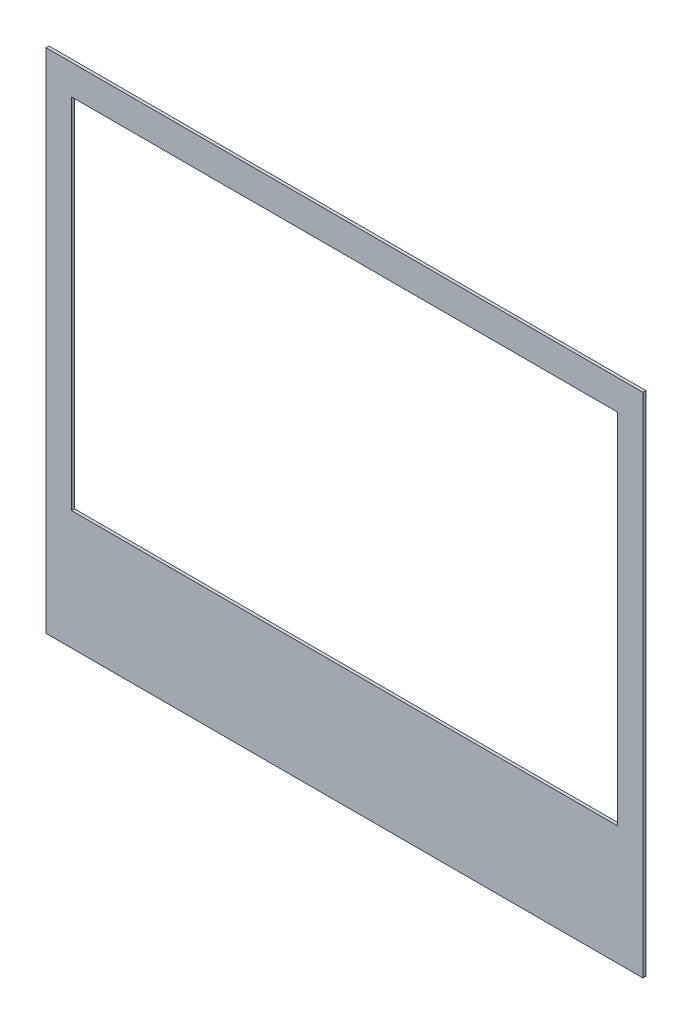
ISO-10303-21;
HEADER;
FILE_DESCRIPTION(('STEP AP214'),'2;1');
FILE_NAME('part.step','',(''),(''),'','','');
FILE_SCHEMA(('AUTOMOTIVE_DESIGN { 1 0 10303 214 1 1 1 1 }'));
ENDSEC;
DATA;
#1=APPLICATION_CONTEXT('core data for automotive mechanical design processes');
#2=APPLICATION_PROTOCOL_DEFINITION('international standard','automotive_design',2000,#1);
#3=PRODUCT_CONTEXT('',#1,'mechanical');
#4=PRODUCT('Part','Part','',(#3));
#5=PRODUCT_RELATED_PRODUCT_CATEGORY('part','',(#4));
#6=PRODUCT_DEFINITION_FORMATION('','',#4);
#7=PRODUCT_DEFINITION_CONTEXT('part definition',#1,'design');
#8=PRODUCT_DEFINITION('design','',#6,#7);
#9=PRODUCT_DEFINITION_SHAPE('','',#8);
#10=(LENGTH_UNIT() NAMED_UNIT(*) SI_UNIT(.MILLI.,.METRE.));
#11=(NAMED_UNIT(*) PLANE_ANGLE_UNIT() SI_UNIT($,.RADIAN.));
#12=(NAMED_UNIT(*) SI_UNIT($,.STERADIAN.) SOLID_ANGLE_UNIT());
#13=UNCERTAINTY_MEASURE_WITH_UNIT(LENGTH_MEASURE(1.E-05),#10,'distance_accuracy_value','');
#14=(GEOMETRIC_REPRESENTATION_CONTEXT(3) GLOBAL_UNCERTAINTY_ASSIGNED_CONTEXT((#13)) GLOBAL_UNIT_ASSIGNED_CONTEXT((#10,
#11,#12)) REPRESENTATION_CONTEXT('',''));
#15=CARTESIAN_POINT('',(0.,0.,0.));
#16=DIRECTION('',(0.,0.,1.));
#17=DIRECTION('',(1.,0.,0.));
#18=AXIS2_PLACEMENT_3D('',#15,#16,#17);
#19=CARTESIAN_POINT('',(0.,0.,0.2));
#20=DIRECTION('',(0.,0.,-1.));
#21=DIRECTION('',(-1.,0.,0.));
#22=AXIS2_PLACEMENT_3D('',#19,#20,#21);
#23=PLANE('',#22);
#24=DIRECTION('',(0.,-1.,0.));
#25=VECTOR('',#24,1.);
#26=CARTESIAN_POINT('',(0.,0.,0.2));
#27=LINE('',#26,#25);
#28=CARTESIAN_POINT('',(0.,33.98,0.2));
#29=VERTEX_POINT('',#28);
#30=CARTESIAN_POINT('',(0.,0.,0.2));
#31=VERTEX_POINT('',#30);
#32=EDGE_CURVE('E136',#29,#31,#27,.T.);
#33=ORIENTED_EDGE('',*,*,#32,.T.);
#34=DIRECTION('',(1.,0.,0.));
#35=VECTOR('',#34,1.);
#36=CARTESIAN_POINT('',(0.,0.,0.2));
#37=LINE('',#36,#35);
#38=CARTESIAN_POINT('',(39.98,0.,0.2));
#39=VERTEX_POINT('',#38);
#40=EDGE_CURVE('E139',#31,#39,#37,.T.);
#41=ORIENTED_EDGE('',*,*,#40,.T.);
#42=DIRECTION('',(0.,1.,0.));
#43=VECTOR('',#42,1.);
#44=CARTESIAN_POINT('',(39.98,0.,0.2));
#45=LINE('',#44,#43);
#46=CARTESIAN_POINT('',(39.98,33.98,0.2));
#47=VERTEX_POINT('',#46);
#48=EDGE_CURVE('E142',#39,#47,#45,.T.);
#49=ORIENTED_EDGE('',*,*,#48,.T.);
#50=DIRECTION('',(-1.,0.,0.));
#51=VECTOR('',#50,1.);
#52=CARTESIAN_POINT('',(0.,33.98,0.2));
#53=LINE('',#52,#51);
#54=EDGE_CURVE('E144',#47,#29,#53,.T.);
#55=ORIENTED_EDGE('',*,*,#54,.T.);
#56=EDGE_LOOP('',(#33,#41,#49,#55));
#57=FACE_BOUND('',#56,.T.);
#58=DIRECTION('',(0.,-1.,0.));
#59=VECTOR('',#58,1.);
#60=CARTESIAN_POINT('',(1.7,31.98,0.2));
#61=LINE('',#60,#59);
#62=CARTESIAN_POINT('',(1.7,31.98,0.2));
#63=VERTEX_POINT('',#62);
#64=CARTESIAN_POINT('',(1.7,7.97999999999999,0.2));
#65=VERTEX_POINT('',#64);
#66=EDGE_CURVE('E100',#63,#65,#61,.T.);
#67=ORIENTED_EDGE('',*,*,#66,.F.);
#68=DIRECTION('',(-1.,0.,0.));
#69=VECTOR('',#68,1.);
#70=CARTESIAN_POINT('',(1.7,31.98,0.2));
#71=LINE('',#70,#69);
#72=CARTESIAN_POINT('',(38.28,31.98,0.2));
#73=VERTEX_POINT('',#72);
#74=EDGE_CURVE('E122',#73,#63,#71,.T.);
#75=ORIENTED_EDGE('',*,*,#74,.F.);
#76=DIRECTION('',(0.,1.,0.));
#77=VECTOR('',#76,1.);
#78=CARTESIAN_POINT('',(38.28,31.98,0.2));
#79=LINE('',#78,#77);
#80=CARTESIAN_POINT('',(38.28,7.97999999999999,0.2));
#81=VERTEX_POINT('',#80);
#82=EDGE_CURVE('E120',#81,#73,#79,.T.);
#83=ORIENTED_EDGE('',*,*,#82,.F.);
#84=DIRECTION('',(1.,0.,0.));
#85=VECTOR('',#84,1.);
#86=CARTESIAN_POINT('',(1.7,7.97999999999999,0.2));
#87=LINE('',#86,#85);
#88=EDGE_CURVE('E108',#65,#81,#87,.T.);
#89=ORIENTED_EDGE('',*,*,#88,.F.);
#90=EDGE_LOOP('',(#67,#75,#83,#89));
#91=FACE_BOUND('',#90,.T.);
#92=ADVANCED_FACE('F35',(#57,#91),#23,.F.);
#93=CARTESIAN_POINT('',(0.,0.,0.));
#94=DIRECTION('',(0.,0.,-1.));
#95=DIRECTION('',(-1.,0.,0.));
#96=AXIS2_PLACEMENT_3D('',#93,#94,#95);
#97=PLANE('',#96);
#98=DIRECTION('',(0.,-1.,0.));
#99=VECTOR('',#98,1.);
#100=CARTESIAN_POINT('',(0.,0.,0.));
#101=LINE('',#100,#99);
#102=CARTESIAN_POINT('',(0.,33.98,0.));
#103=VERTEX_POINT('',#102);
#104=CARTESIAN_POINT('',(0.,0.,0.));
#105=VERTEX_POINT('',#104);
#106=EDGE_CURVE('E116',#103,#105,#101,.T.);
#107=ORIENTED_EDGE('',*,*,#106,.F.);
#108=DIRECTION('',(-1.,0.,0.));
#109=VECTOR('',#108,1.);
#110=CARTESIAN_POINT('',(0.,33.98,0.));
#111=LINE('',#110,#109);
#112=CARTESIAN_POINT('',(39.98,33.98,0.));
#113=VERTEX_POINT('',#112);
#114=EDGE_CURVE('E140',#113,#103,#111,.T.);
#115=ORIENTED_EDGE('',*,*,#114,.F.);
#116=DIRECTION('',(0.,1.,0.));
#117=VECTOR('',#116,1.);
#118=CARTESIAN_POINT('',(39.98,0.,0.));
#119=LINE('',#118,#117);
#120=CARTESIAN_POINT('',(39.98,0.,0.));
#121=VERTEX_POINT('',#120);
#122=EDGE_CURVE('E151',#121,#113,#119,.T.);
#123=ORIENTED_EDGE('',*,*,#122,.F.);
#124=DIRECTION('',(1.,0.,0.));
#125=VECTOR('',#124,1.);
#126=CARTESIAN_POINT('',(0.,0.,0.));
#127=LINE('',#126,#125);
#128=EDGE_CURVE('E149',#105,#121,#127,.T.);
#129=ORIENTED_EDGE('',*,*,#128,.F.);
#130=EDGE_LOOP('',(#107,#115,#123,#129));
#131=FACE_BOUND('',#130,.T.);
#132=DIRECTION('',(-1.,0.,0.));
#133=VECTOR('',#132,1.);
#134=CARTESIAN_POINT('',(1.7,31.98,0.));
#135=LINE('',#134,#133);
#136=CARTESIAN_POINT('',(38.28,31.98,0.));
#137=VERTEX_POINT('',#136);
#138=CARTESIAN_POINT('',(1.7,31.98,0.));
#139=VERTEX_POINT('',#138);
#140=EDGE_CURVE('E109',#137,#139,#135,.T.);
#141=ORIENTED_EDGE('',*,*,#140,.T.);
#142=DIRECTION('',(0.,-1.,0.));
#143=VECTOR('',#142,1.);
#144=CARTESIAN_POINT('',(1.7,31.98,0.));
#145=LINE('',#144,#143);
#146=CARTESIAN_POINT('',(1.7,7.97999999999999,0.));
#147=VERTEX_POINT('',#146);
#148=EDGE_CURVE('E58',#139,#147,#145,.T.);
#149=ORIENTED_EDGE('',*,*,#148,.T.);
#150=DIRECTION('',(1.,0.,0.));
#151=VECTOR('',#150,1.);
#152=CARTESIAN_POINT('',(1.7,7.97999999999999,0.));
#153=LINE('',#152,#151);
#154=CARTESIAN_POINT('',(38.28,7.97999999999999,0.));
#155=VERTEX_POINT('',#154);
#156=EDGE_CURVE('E115',#147,#155,#153,.T.);
#157=ORIENTED_EDGE('',*,*,#156,.T.);
#158=DIRECTION('',(0.,1.,0.));
#159=VECTOR('',#158,1.);
#160=CARTESIAN_POINT('',(38.28,31.98,0.));
#161=LINE('',#160,#159);
#162=EDGE_CURVE('E128',#155,#137,#161,.T.);
#163=ORIENTED_EDGE('',*,*,#162,.T.);
#164=EDGE_LOOP('',(#141,#149,#157,#163));
#165=FACE_BOUND('',#164,.T.);
#166=ADVANCED_FACE('F169',(#131,#165),#97,.T.);
#167=CARTESIAN_POINT('',(0.,0.,0.2));
#168=DIRECTION('',(1.,0.,0.));
#169=DIRECTION('',(0.,0.,-1.));
#170=AXIS2_PLACEMENT_3D('',#167,#168,#169);
#171=PLANE('',#170);
#172=ORIENTED_EDGE('',*,*,#106,.T.);
#173=DIRECTION('',(0.,0.,-1.));
#174=VECTOR('',#173,1.);
#175=CARTESIAN_POINT('',(0.,0.,0.2));
#176=LINE('',#175,#174);
#177=EDGE_CURVE('E11',#31,#105,#176,.T.);
#178=ORIENTED_EDGE('',*,*,#177,.F.);
#179=ORIENTED_EDGE('',*,*,#32,.F.);
#180=DIRECTION('',(0.,0.,-1.));
#181=VECTOR('',#180,1.);
#182=CARTESIAN_POINT('',(0.,33.98,0.2));
#183=LINE('',#182,#181);
#184=EDGE_CURVE('E146',#29,#103,#183,.T.);
#185=ORIENTED_EDGE('',*,*,#184,.T.);
#186=EDGE_LOOP('',(#172,#178,#179,#185));
#187=FACE_BOUND('',#186,.T.);
#188=ADVANCED_FACE('F37',(#187),#171,.F.);
#189=CARTESIAN_POINT('',(0.,0.,0.2));
#190=DIRECTION('',(0.,1.,0.));
#191=DIRECTION('',(0.,0.,1.));
#192=AXIS2_PLACEMENT_3D('',#189,#190,#191);
#193=PLANE('',#192);
#194=ORIENTED_EDGE('',*,*,#128,.T.);
#195=DIRECTION('',(0.,0.,-1.));
#196=VECTOR('',#195,1.);
#197=CARTESIAN_POINT('',(39.98,0.,0.2));
#198=LINE('',#197,#196);
#199=EDGE_CURVE('E43',#39,#121,#198,.T.);
#200=ORIENTED_EDGE('',*,*,#199,.F.);
#201=ORIENTED_EDGE('',*,*,#40,.F.);
#202=ORIENTED_EDGE('',*,*,#177,.T.);
#203=EDGE_LOOP('',(#194,#200,#201,#202));
#204=FACE_BOUND('',#203,.T.);
#205=ADVANCED_FACE('F179',(#204),#193,.F.);
#206=CARTESIAN_POINT('',(39.98,0.,0.2));
#207=DIRECTION('',(-1.,0.,0.));
#208=DIRECTION('',(0.,0.,1.));
#209=AXIS2_PLACEMENT_3D('',#206,#207,#208);
#210=PLANE('',#209);
#211=ORIENTED_EDGE('',*,*,#122,.T.);
#212=DIRECTION('',(0.,0.,-1.));
#213=VECTOR('',#212,1.);
#214=CARTESIAN_POINT('',(39.98,33.98,0.2));
#215=LINE('',#214,#213);
#216=EDGE_CURVE('E156',#47,#113,#215,.T.);
#217=ORIENTED_EDGE('',*,*,#216,.F.);
#218=ORIENTED_EDGE('',*,*,#48,.F.);
#219=ORIENTED_EDGE('',*,*,#199,.T.);
#220=EDGE_LOOP('',(#211,#217,#218,#219));
#221=FACE_BOUND('',#220,.T.);
#222=ADVANCED_FACE('F163',(#221),#210,.F.);
#223=CARTESIAN_POINT('',(0.,33.98,0.2));
#224=DIRECTION('',(0.,-1.,0.));
#225=DIRECTION('',(0.,0.,-1.));
#226=AXIS2_PLACEMENT_3D('',#223,#224,#225);
#227=PLANE('',#226);
#228=ORIENTED_EDGE('',*,*,#114,.T.);
#229=ORIENTED_EDGE('',*,*,#184,.F.);
#230=ORIENTED_EDGE('',*,*,#54,.F.);
#231=ORIENTED_EDGE('',*,*,#216,.T.);
#232=EDGE_LOOP('',(#228,#229,#230,#231));
#233=FACE_BOUND('',#232,.T.);
#234=ADVANCED_FACE('F173',(#233),#227,.F.);
#235=CARTESIAN_POINT('',(1.7,31.98,0.2));
#236=DIRECTION('',(1.,0.,0.));
#237=DIRECTION('',(0.,1.,0.));
#238=AXIS2_PLACEMENT_3D('',#235,#236,#237);
#239=PLANE('',#238);
#240=ORIENTED_EDGE('',*,*,#148,.F.);
#241=DIRECTION('',(0.,0.,-1.));
#242=VECTOR('',#241,1.);
#243=CARTESIAN_POINT('',(1.7,31.98,0.2));
#244=LINE('',#243,#242);
#245=EDGE_CURVE('E104',#63,#139,#244,.T.);
#246=ORIENTED_EDGE('',*,*,#245,.F.);
#247=ORIENTED_EDGE('',*,*,#66,.T.);
#248=DIRECTION('',(0.,0.,-1.));
#249=VECTOR('',#248,1.);
#250=CARTESIAN_POINT('',(1.7,7.97999999999999,0.2));
#251=LINE('',#250,#249);
#252=EDGE_CURVE('E103',#65,#147,#251,.T.);
#253=ORIENTED_EDGE('',*,*,#252,.T.);
#254=EDGE_LOOP('',(#240,#246,#247,#253));
#255=FACE_BOUND('',#254,.T.);
#256=ADVANCED_FACE('F102',(#255),#239,.T.);
#257=CARTESIAN_POINT('',(1.7,7.97999999999999,0.2));
#258=DIRECTION('',(0.,1.,0.));
#259=DIRECTION('',(0.,0.,1.));
#260=AXIS2_PLACEMENT_3D('',#257,#258,#259);
#261=PLANE('',#260);
#262=ORIENTED_EDGE('',*,*,#156,.F.);
#263=ORIENTED_EDGE('',*,*,#252,.F.);
#264=ORIENTED_EDGE('',*,*,#88,.T.);
#265=DIRECTION('',(0.,0.,-1.));
#266=VECTOR('',#265,1.);
#267=CARTESIAN_POINT('',(38.28,7.97999999999999,0.2));
#268=LINE('',#267,#266);
#269=EDGE_CURVE('E117',#81,#155,#268,.T.);
#270=ORIENTED_EDGE('',*,*,#269,.T.);
#271=EDGE_LOOP('',(#262,#263,#264,#270));
#272=FACE_BOUND('',#271,.T.);
#273=ADVANCED_FACE('F112',(#272),#261,.T.);
#274=CARTESIAN_POINT('',(38.28,31.98,0.2));
#275=DIRECTION('',(-1.,0.,0.));
#276=DIRECTION('',(0.,0.,1.));
#277=AXIS2_PLACEMENT_3D('',#274,#275,#276);
#278=PLANE('',#277);
#279=ORIENTED_EDGE('',*,*,#162,.F.);
#280=ORIENTED_EDGE('',*,*,#269,.F.);
#281=ORIENTED_EDGE('',*,*,#82,.T.);
#282=DIRECTION('',(0.,0.,-1.));
#283=VECTOR('',#282,1.);
#284=CARTESIAN_POINT('',(38.28,31.98,0.2));
#285=LINE('',#284,#283);
#286=EDGE_CURVE('E50',#73,#137,#285,.T.);
#287=ORIENTED_EDGE('',*,*,#286,.T.);
#288=EDGE_LOOP('',(#279,#280,#281,#287));
#289=FACE_BOUND('',#288,.T.);
#290=ADVANCED_FACE('F202',(#289),#278,.T.);
#291=CARTESIAN_POINT('',(1.7,31.98,0.2));
#292=DIRECTION('',(0.,-1.,0.));
#293=DIRECTION('',(0.,0.,-1.));
#294=AXIS2_PLACEMENT_3D('',#291,#292,#293);
#295=PLANE('',#294);
#296=ORIENTED_EDGE('',*,*,#140,.F.);
#297=ORIENTED_EDGE('',*,*,#286,.F.);
#298=ORIENTED_EDGE('',*,*,#74,.T.);
#299=ORIENTED_EDGE('',*,*,#245,.T.);
#300=EDGE_LOOP('',(#296,#297,#298,#299));
#301=FACE_BOUND('',#300,.T.);
#302=ADVANCED_FACE('F206',(#301),#295,.T.);
#303=CLOSED_SHELL('',(#92,#166,#188,#205,#222,#234,#256,#273,#290,#302));
#304=MANIFOLD_SOLID_BREP('B2',#303);
#305=ADVANCED_BREP_SHAPE_REPRESENTATION('',(#18,#304),#14);
#306=SHAPE_DEFINITION_REPRESENTATION(#9,#305);
ENDSEC;
END-ISO-10303-21;
